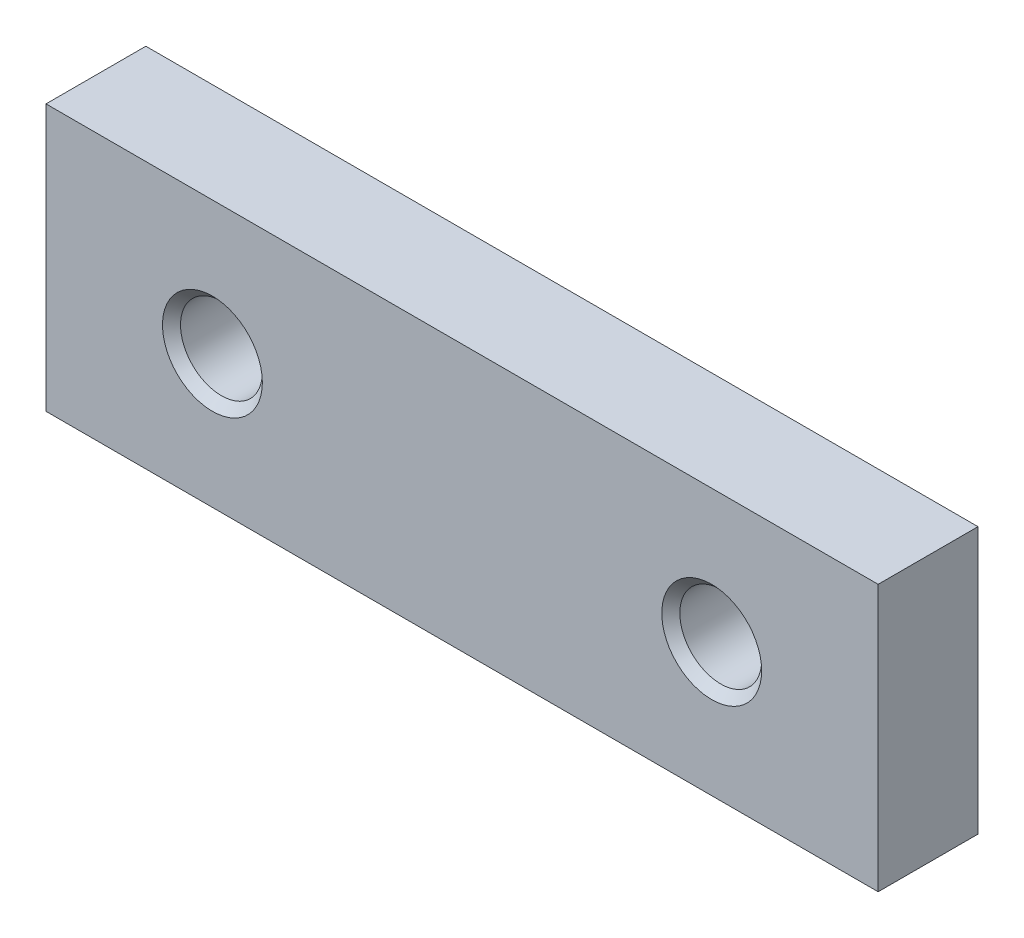
ISO-10303-21;
HEADER;
FILE_DESCRIPTION(('STEP AP214'),'2;1');
FILE_NAME('part.step','',(''),(''),'','','');
FILE_SCHEMA(('AUTOMOTIVE_DESIGN { 1 0 10303 214 1 1 1 1 }'));
ENDSEC;
DATA;
#1=APPLICATION_CONTEXT('core data for automotive mechanical design processes');
#2=APPLICATION_PROTOCOL_DEFINITION('international standard','automotive_design',2000,#1);
#3=PRODUCT_CONTEXT('',#1,'mechanical');
#4=PRODUCT('Part','Part','',(#3));
#5=PRODUCT_RELATED_PRODUCT_CATEGORY('part','',(#4));
#6=PRODUCT_DEFINITION_FORMATION('','',#4);
#7=PRODUCT_DEFINITION_CONTEXT('part definition',#1,'design');
#8=PRODUCT_DEFINITION('design','',#6,#7);
#9=PRODUCT_DEFINITION_SHAPE('','',#8);
#10=(LENGTH_UNIT() NAMED_UNIT(*) SI_UNIT(.MILLI.,.METRE.));
#11=(NAMED_UNIT(*) PLANE_ANGLE_UNIT() SI_UNIT($,.RADIAN.));
#12=(NAMED_UNIT(*) SI_UNIT($,.STERADIAN.) SOLID_ANGLE_UNIT());
#13=UNCERTAINTY_MEASURE_WITH_UNIT(LENGTH_MEASURE(1.E-05),#10,'distance_accuracy_value','');
#14=(GEOMETRIC_REPRESENTATION_CONTEXT(3) GLOBAL_UNCERTAINTY_ASSIGNED_CONTEXT((#13)) GLOBAL_UNIT_ASSIGNED_CONTEXT((#10,
#11,#12)) REPRESENTATION_CONTEXT('',''));
#15=CARTESIAN_POINT('',(0.,0.,0.));
#16=DIRECTION('',(0.,0.,1.));
#17=DIRECTION('',(1.,0.,0.));
#18=AXIS2_PLACEMENT_3D('',#15,#16,#17);
#19=CARTESIAN_POINT('',(-10.,-8.,3.));
#20=DIRECTION('',(0.,0.,1.));
#21=DIRECTION('',(1.,0.,0.));
#22=AXIS2_PLACEMENT_3D('',#19,#20,#21);
#23=PLANE('',#22);
#24=CARTESIAN_POINT('',(0.,0.,3.));
#25=DIRECTION('',(0.,0.,1.));
#26=DIRECTION('',(1.,0.,0.));
#27=AXIS2_PLACEMENT_3D('',#24,#25,#26);
#28=CIRCLE('',#27,3.);
#29=CARTESIAN_POINT('',(3.,0.,3.));
#30=VERTEX_POINT('',#29);
#31=EDGE_CURVE('E103',#30,#30,#28,.T.);
#32=ORIENTED_EDGE('',*,*,#31,.F.);
#33=EDGE_LOOP('',(#32));
#34=FACE_BOUND('',#33,.T.);
#35=DIRECTION('',(0.,-1.,0.));
#36=VECTOR('',#35,1.);
#37=CARTESIAN_POINT('',(-10.,8.,3.));
#38=LINE('',#37,#36);
#39=CARTESIAN_POINT('',(-10.,8.,3.));
#40=VERTEX_POINT('',#39);
#41=CARTESIAN_POINT('',(-10.,-8.,3.));
#42=VERTEX_POINT('',#41);
#43=EDGE_CURVE('E113',#40,#42,#38,.T.);
#44=ORIENTED_EDGE('',*,*,#43,.T.);
#45=DIRECTION('',(1.,0.,0.));
#46=VECTOR('',#45,1.);
#47=CARTESIAN_POINT('',(-10.,-8.,3.));
#48=LINE('',#47,#46);
#49=CARTESIAN_POINT('',(40.,-8.,3.));
#50=VERTEX_POINT('',#49);
#51=EDGE_CURVE('E87',#42,#50,#48,.T.);
#52=ORIENTED_EDGE('',*,*,#51,.T.);
#53=DIRECTION('',(0.,1.,0.));
#54=VECTOR('',#53,1.);
#55=CARTESIAN_POINT('',(40.,-8.,3.));
#56=LINE('',#55,#54);
#57=CARTESIAN_POINT('',(40.,8.,3.));
#58=VERTEX_POINT('',#57);
#59=EDGE_CURVE('E63',#50,#58,#56,.T.);
#60=ORIENTED_EDGE('',*,*,#59,.T.);
#61=DIRECTION('',(-1.,0.,0.));
#62=VECTOR('',#61,1.);
#63=CARTESIAN_POINT('',(40.,8.,3.));
#64=LINE('',#63,#62);
#65=EDGE_CURVE('E58',#58,#40,#64,.T.);
#66=ORIENTED_EDGE('',*,*,#65,.T.);
#67=EDGE_LOOP('',(#44,#52,#60,#66));
#68=FACE_BOUND('',#67,.T.);
#69=CARTESIAN_POINT('',(30.,0.,3.));
#70=DIRECTION('',(0.,0.,1.));
#71=DIRECTION('',(1.,0.,0.));
#72=AXIS2_PLACEMENT_3D('',#69,#70,#71);
#73=CIRCLE('',#72,3.);
#74=CARTESIAN_POINT('',(33.,0.,3.));
#75=VERTEX_POINT('',#74);
#76=EDGE_CURVE('E130',#75,#75,#73,.T.);
#77=ORIENTED_EDGE('',*,*,#76,.F.);
#78=EDGE_LOOP('',(#77));
#79=FACE_BOUND('',#78,.T.);
#80=ADVANCED_FACE('F43',(#34,#68,#79),#23,.T.);
#81=CARTESIAN_POINT('',(-10.,-8.,-3.));
#82=DIRECTION('',(0.,0.,1.));
#83=DIRECTION('',(1.,0.,0.));
#84=AXIS2_PLACEMENT_3D('',#81,#82,#83);
#85=PLANE('',#84);
#86=CARTESIAN_POINT('',(0.,0.,-3.));
#87=DIRECTION('',(0.,0.,1.));
#88=DIRECTION('',(1.,0.,0.));
#89=AXIS2_PLACEMENT_3D('',#86,#87,#88);
#90=CIRCLE('',#89,3.);
#91=CARTESIAN_POINT('',(3.,0.,-3.));
#92=VERTEX_POINT('',#91);
#93=EDGE_CURVE('E132',#92,#92,#90,.T.);
#94=ORIENTED_EDGE('',*,*,#93,.T.);
#95=EDGE_LOOP('',(#94));
#96=FACE_BOUND('',#95,.T.);
#97=DIRECTION('',(0.,-1.,0.));
#98=VECTOR('',#97,1.);
#99=CARTESIAN_POINT('',(-10.,8.,-3.));
#100=LINE('',#99,#98);
#101=CARTESIAN_POINT('',(-10.,8.,-3.));
#102=VERTEX_POINT('',#101);
#103=CARTESIAN_POINT('',(-10.,-8.,-3.));
#104=VERTEX_POINT('',#103);
#105=EDGE_CURVE('E97',#102,#104,#100,.T.);
#106=ORIENTED_EDGE('',*,*,#105,.F.);
#107=DIRECTION('',(-1.,0.,0.));
#108=VECTOR('',#107,1.);
#109=CARTESIAN_POINT('',(40.,8.,-3.));
#110=LINE('',#109,#108);
#111=CARTESIAN_POINT('',(40.,8.,-3.));
#112=VERTEX_POINT('',#111);
#113=EDGE_CURVE('E111',#112,#102,#110,.T.);
#114=ORIENTED_EDGE('',*,*,#113,.F.);
#115=DIRECTION('',(0.,1.,0.));
#116=VECTOR('',#115,1.);
#117=CARTESIAN_POINT('',(40.,-8.,-3.));
#118=LINE('',#117,#116);
#119=CARTESIAN_POINT('',(40.,-8.,-3.));
#120=VERTEX_POINT('',#119);
#121=EDGE_CURVE('E100',#120,#112,#118,.T.);
#122=ORIENTED_EDGE('',*,*,#121,.F.);
#123=DIRECTION('',(1.,0.,0.));
#124=VECTOR('',#123,1.);
#125=CARTESIAN_POINT('',(-10.,-8.,-3.));
#126=LINE('',#125,#124);
#127=EDGE_CURVE('E86',#104,#120,#126,.T.);
#128=ORIENTED_EDGE('',*,*,#127,.F.);
#129=EDGE_LOOP('',(#106,#114,#122,#128));
#130=FACE_BOUND('',#129,.T.);
#131=CARTESIAN_POINT('',(30.,0.,-3.));
#132=DIRECTION('',(0.,0.,1.));
#133=DIRECTION('',(1.,0.,0.));
#134=AXIS2_PLACEMENT_3D('',#131,#132,#133);
#135=CIRCLE('',#134,3.);
#136=CARTESIAN_POINT('',(33.,0.,-3.));
#137=VERTEX_POINT('',#136);
#138=EDGE_CURVE('E249',#137,#137,#135,.T.);
#139=ORIENTED_EDGE('',*,*,#138,.T.);
#140=EDGE_LOOP('',(#139));
#141=FACE_BOUND('',#140,.T.);
#142=ADVANCED_FACE('F94',(#96,#130,#141),#85,.F.);
#143=CARTESIAN_POINT('',(-10.,8.,3.));
#144=DIRECTION('',(1.,0.,0.));
#145=DIRECTION('',(0.,0.,-1.));
#146=AXIS2_PLACEMENT_3D('',#143,#144,#145);
#147=PLANE('',#146);
#148=DIRECTION('',(0.,0.,-1.));
#149=VECTOR('',#148,1.);
#150=CARTESIAN_POINT('',(-10.,8.,3.));
#151=LINE('',#150,#149);
#152=EDGE_CURVE('E102',#40,#102,#151,.T.);
#153=ORIENTED_EDGE('',*,*,#152,.T.);
#154=ORIENTED_EDGE('',*,*,#105,.T.);
#155=DIRECTION('',(0.,0.,-1.));
#156=VECTOR('',#155,1.);
#157=CARTESIAN_POINT('',(-10.,-8.,3.));
#158=LINE('',#157,#156);
#159=EDGE_CURVE('E11',#42,#104,#158,.T.);
#160=ORIENTED_EDGE('',*,*,#159,.F.);
#161=ORIENTED_EDGE('',*,*,#43,.F.);
#162=EDGE_LOOP('',(#153,#154,#160,#161));
#163=FACE_BOUND('',#162,.T.);
#164=ADVANCED_FACE('F45',(#163),#147,.F.);
#165=CARTESIAN_POINT('',(-10.,-8.,3.));
#166=DIRECTION('',(0.,1.,0.));
#167=DIRECTION('',(0.,0.,1.));
#168=AXIS2_PLACEMENT_3D('',#165,#166,#167);
#169=PLANE('',#168);
#170=ORIENTED_EDGE('',*,*,#159,.T.);
#171=ORIENTED_EDGE('',*,*,#127,.T.);
#172=DIRECTION('',(0.,0.,-1.));
#173=VECTOR('',#172,1.);
#174=CARTESIAN_POINT('',(40.,-8.,3.));
#175=LINE('',#174,#173);
#176=EDGE_CURVE('E51',#50,#120,#175,.T.);
#177=ORIENTED_EDGE('',*,*,#176,.F.);
#178=ORIENTED_EDGE('',*,*,#51,.F.);
#179=EDGE_LOOP('',(#170,#171,#177,#178));
#180=FACE_BOUND('',#179,.T.);
#181=ADVANCED_FACE('F84',(#180),#169,.F.);
#182=CARTESIAN_POINT('',(40.,-8.,3.));
#183=DIRECTION('',(-1.,0.,0.));
#184=DIRECTION('',(0.,0.,1.));
#185=AXIS2_PLACEMENT_3D('',#182,#183,#184);
#186=PLANE('',#185);
#187=ORIENTED_EDGE('',*,*,#176,.T.);
#188=ORIENTED_EDGE('',*,*,#121,.T.);
#189=DIRECTION('',(0.,0.,-1.));
#190=VECTOR('',#189,1.);
#191=CARTESIAN_POINT('',(40.,8.,3.));
#192=LINE('',#191,#190);
#193=EDGE_CURVE('E119',#58,#112,#192,.T.);
#194=ORIENTED_EDGE('',*,*,#193,.F.);
#195=ORIENTED_EDGE('',*,*,#59,.F.);
#196=EDGE_LOOP('',(#187,#188,#194,#195));
#197=FACE_BOUND('',#196,.T.);
#198=ADVANCED_FACE('F121',(#197),#186,.F.);
#199=CARTESIAN_POINT('',(40.,8.,3.));
#200=DIRECTION('',(0.,-1.,0.));
#201=DIRECTION('',(0.,0.,-1.));
#202=AXIS2_PLACEMENT_3D('',#199,#200,#201);
#203=PLANE('',#202);
#204=ORIENTED_EDGE('',*,*,#193,.T.);
#205=ORIENTED_EDGE('',*,*,#113,.T.);
#206=ORIENTED_EDGE('',*,*,#152,.F.);
#207=ORIENTED_EDGE('',*,*,#65,.F.);
#208=EDGE_LOOP('',(#204,#205,#206,#207));
#209=FACE_BOUND('',#208,.T.);
#210=ADVANCED_FACE('F123',(#209),#203,.F.);
#211=CARTESIAN_POINT('',(0.,0.,2.4585));
#212=DIRECTION('',(0.,0.,1.));
#213=DIRECTION('',(1.,0.,0.));
#214=AXIS2_PLACEMENT_3D('',#211,#212,#213);
#215=CONICAL_SURFACE('',#214,2.4585,0.785398163397448);
#216=ORIENTED_EDGE('',*,*,#31,.T.);
#217=EDGE_LOOP('',(#216));
#218=FACE_BOUND('',#217,.T.);
#219=CARTESIAN_POINT('',(0.,0.,2.4585));
#220=DIRECTION('',(0.,0.,1.));
#221=DIRECTION('',(1.,0.,0.));
#222=AXIS2_PLACEMENT_3D('',#219,#220,#221);
#223=CIRCLE('',#222,2.4585);
#224=CARTESIAN_POINT('',(2.4585,0.,2.4585));
#225=VERTEX_POINT('',#224);
#226=EDGE_CURVE('E106',#225,#225,#223,.T.);
#227=ORIENTED_EDGE('',*,*,#226,.F.);
#228=EDGE_LOOP('',(#227));
#229=FACE_BOUND('',#228,.T.);
#230=ADVANCED_FACE('F150',(#218,#229),#215,.F.);
#231=CARTESIAN_POINT('',(0.,0.,-3.));
#232=DIRECTION('',(0.,0.,1.));
#233=DIRECTION('',(1.,0.,0.));
#234=AXIS2_PLACEMENT_3D('',#231,#232,#233);
#235=CYLINDRICAL_SURFACE('',#234,2.4585);
#236=ORIENTED_EDGE('',*,*,#226,.T.);
#237=EDGE_LOOP('',(#236));
#238=FACE_BOUND('',#237,.T.);
#239=CARTESIAN_POINT('',(0.,0.,-2.4585));
#240=DIRECTION('',(0.,0.,1.));
#241=DIRECTION('',(1.,0.,0.));
#242=AXIS2_PLACEMENT_3D('',#239,#240,#241);
#243=CIRCLE('',#242,2.4585);
#244=CARTESIAN_POINT('',(2.4585,0.,-2.4585));
#245=VERTEX_POINT('',#244);
#246=EDGE_CURVE('E136',#245,#245,#243,.T.);
#247=ORIENTED_EDGE('',*,*,#246,.F.);
#248=EDGE_LOOP('',(#247));
#249=FACE_BOUND('',#248,.T.);
#250=ADVANCED_FACE('F147',(#238,#249),#235,.F.);
#251=CARTESIAN_POINT('',(0.,0.,-3.));
#252=DIRECTION('',(0.,0.,-1.));
#253=DIRECTION('',(-1.,0.,0.));
#254=AXIS2_PLACEMENT_3D('',#251,#252,#253);
#255=CONICAL_SURFACE('',#254,3.,0.785398163397448);
#256=ORIENTED_EDGE('',*,*,#246,.T.);
#257=EDGE_LOOP('',(#256));
#258=FACE_BOUND('',#257,.T.);
#259=ORIENTED_EDGE('',*,*,#93,.F.);
#260=EDGE_LOOP('',(#259));
#261=FACE_BOUND('',#260,.T.);
#262=ADVANCED_FACE('F159',(#258,#261),#255,.F.);
#263=CARTESIAN_POINT('',(30.,0.,2.4585));
#264=DIRECTION('',(0.,0.,1.));
#265=DIRECTION('',(1.,0.,0.));
#266=AXIS2_PLACEMENT_3D('',#263,#264,#265);
#267=CONICAL_SURFACE('',#266,2.4585,0.785398163397448);
#268=ORIENTED_EDGE('',*,*,#76,.T.);
#269=EDGE_LOOP('',(#268));
#270=FACE_BOUND('',#269,.T.);
#271=CARTESIAN_POINT('',(30.,0.,2.4585));
#272=DIRECTION('',(0.,0.,1.));
#273=DIRECTION('',(1.,0.,0.));
#274=AXIS2_PLACEMENT_3D('',#271,#272,#273);
#275=CIRCLE('',#274,2.4585);
#276=CARTESIAN_POINT('',(32.4585,0.,2.4585));
#277=VERTEX_POINT('',#276);
#278=EDGE_CURVE('E133',#277,#277,#275,.T.);
#279=ORIENTED_EDGE('',*,*,#278,.F.);
#280=EDGE_LOOP('',(#279));
#281=FACE_BOUND('',#280,.T.);
#282=ADVANCED_FACE('F210',(#270,#281),#267,.F.);
#283=CARTESIAN_POINT('',(30.,0.,-3.));
#284=DIRECTION('',(0.,0.,1.));
#285=DIRECTION('',(1.,0.,0.));
#286=AXIS2_PLACEMENT_3D('',#283,#284,#285);
#287=CYLINDRICAL_SURFACE('',#286,2.4585);
#288=ORIENTED_EDGE('',*,*,#278,.T.);
#289=EDGE_LOOP('',(#288));
#290=FACE_BOUND('',#289,.T.);
#291=CARTESIAN_POINT('',(30.,0.,-2.4585));
#292=DIRECTION('',(0.,0.,1.));
#293=DIRECTION('',(1.,0.,0.));
#294=AXIS2_PLACEMENT_3D('',#291,#292,#293);
#295=CIRCLE('',#294,2.4585);
#296=CARTESIAN_POINT('',(32.4585,0.,-2.4585));
#297=VERTEX_POINT('',#296);
#298=EDGE_CURVE('E139',#297,#297,#295,.T.);
#299=ORIENTED_EDGE('',*,*,#298,.F.);
#300=EDGE_LOOP('',(#299));
#301=FACE_BOUND('',#300,.T.);
#302=ADVANCED_FACE('F225',(#290,#301),#287,.F.);
#303=CARTESIAN_POINT('',(30.,0.,-3.));
#304=DIRECTION('',(0.,0.,-1.));
#305=DIRECTION('',(-1.,0.,0.));
#306=AXIS2_PLACEMENT_3D('',#303,#304,#305);
#307=CONICAL_SURFACE('',#306,3.,0.785398163397448);
#308=ORIENTED_EDGE('',*,*,#298,.T.);
#309=EDGE_LOOP('',(#308));
#310=FACE_BOUND('',#309,.T.);
#311=ORIENTED_EDGE('',*,*,#138,.F.);
#312=EDGE_LOOP('',(#311));
#313=FACE_BOUND('',#312,.T.);
#314=ADVANCED_FACE('F233',(#310,#313),#307,.F.);
#315=CLOSED_SHELL('',(#80,#142,#164,#181,#198,#210,#230,#250,#262,#282,#302,#314));
#316=MANIFOLD_SOLID_BREP('B2',#315);
#317=ADVANCED_BREP_SHAPE_REPRESENTATION('',(#18,#316),#14);
#318=SHAPE_DEFINITION_REPRESENTATION(#9,#317);
ENDSEC;
END-ISO-10303-21;
